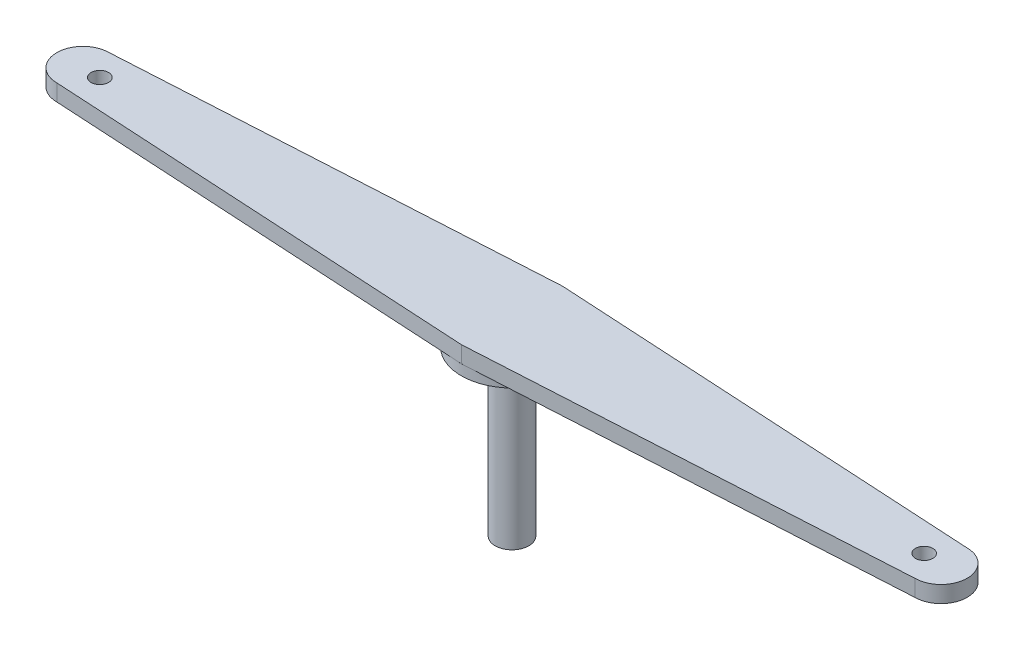
ISO-10303-21;
HEADER;
FILE_DESCRIPTION(('STEP AP214'),'2;1');
FILE_NAME('part.step','',(''),(''),'','','');
FILE_SCHEMA(('AUTOMOTIVE_DESIGN { 1 0 10303 214 1 1 1 1 }'));
ENDSEC;
DATA;
#1=APPLICATION_CONTEXT('core data for automotive mechanical design processes');
#2=APPLICATION_PROTOCOL_DEFINITION('international standard','automotive_design',2000,#1);
#3=PRODUCT_CONTEXT('',#1,'mechanical');
#4=PRODUCT('Part','Part','',(#3));
#5=PRODUCT_RELATED_PRODUCT_CATEGORY('part','',(#4));
#6=PRODUCT_DEFINITION_FORMATION('','',#4);
#7=PRODUCT_DEFINITION_CONTEXT('part definition',#1,'design');
#8=PRODUCT_DEFINITION('design','',#6,#7);
#9=PRODUCT_DEFINITION_SHAPE('','',#8);
#10=(LENGTH_UNIT() NAMED_UNIT(*) SI_UNIT(.MILLI.,.METRE.));
#11=(NAMED_UNIT(*) PLANE_ANGLE_UNIT() SI_UNIT($,.RADIAN.));
#12=(NAMED_UNIT(*) SI_UNIT($,.STERADIAN.) SOLID_ANGLE_UNIT());
#13=UNCERTAINTY_MEASURE_WITH_UNIT(LENGTH_MEASURE(1.E-05),#10,'distance_accuracy_value','');
#14=(GEOMETRIC_REPRESENTATION_CONTEXT(3) GLOBAL_UNCERTAINTY_ASSIGNED_CONTEXT((#13)) GLOBAL_UNIT_ASSIGNED_CONTEXT((#10,
#11,#12)) REPRESENTATION_CONTEXT('',''));
#15=CARTESIAN_POINT('',(0.,0.,0.));
#16=DIRECTION('',(0.,0.,1.));
#17=DIRECTION('',(1.,0.,0.));
#18=AXIS2_PLACEMENT_3D('',#15,#16,#17);
#19=CARTESIAN_POINT('',(0.,0.,0.));
#20=DIRECTION('',(0.,1.,0.));
#21=DIRECTION('',(0.,0.,1.));
#22=AXIS2_PLACEMENT_3D('',#19,#20,#21);
#23=PLANE('',#22);
#24=CARTESIAN_POINT('',(-118.059682160385,0.,0.));
#25=DIRECTION('',(0.,1.,0.));
#26=DIRECTION('',(0.,0.,1.));
#27=AXIS2_PLACEMENT_3D('',#24,#25,#26);
#28=CIRCLE('',#27,2.49999999999999);
#29=CARTESIAN_POINT('',(-118.059682160385,0.,2.49999999999999));
#30=VERTEX_POINT('',#29);
#31=EDGE_CURVE('E186',#30,#30,#28,.F.);
#32=ORIENTED_EDGE('',*,*,#31,.F.);
#33=EDGE_LOOP('',(#32));
#34=FACE_BOUND('',#33,.T.);
#35=CARTESIAN_POINT('',(0.,0.,0.));
#36=DIRECTION('',(0.,-1.,0.));
#37=DIRECTION('',(0.,0.,-1.));
#38=AXIS2_PLACEMENT_3D('',#35,#36,#37);
#39=CIRCLE('',#38,14.5);
#40=CARTESIAN_POINT('',(-1.64640830017799,0.,14.4062257274105));
#41=VERTEX_POINT('',#40);
#42=CARTESIAN_POINT('',(-1.64640830017799,0.,-14.4062257274105));
#43=VERTEX_POINT('',#42);
#44=EDGE_CURVE('E208',#41,#43,#39,.T.);
#45=ORIENTED_EDGE('',*,*,#44,.F.);
#46=DIRECTION('',(-0.998381893061701,0.,-0.0568647131930993));
#47=VECTOR('',#46,1.);
#48=CARTESIAN_POINT('',(-0.823204150088989,0.,14.4531128637053));
#49=LINE('',#48,#47);
#50=CARTESIAN_POINT('',(-122.9,0.,7.50000000000001));
#51=VERTEX_POINT('',#50);
#52=EDGE_CURVE('E164',#41,#51,#49,.T.);
#53=ORIENTED_EDGE('',*,*,#52,.T.);
#54=CARTESIAN_POINT('',(-122.9,0.,0.));
#55=DIRECTION('',(0.,1.,0.));
#56=DIRECTION('',(0.,0.,1.));
#57=AXIS2_PLACEMENT_3D('',#54,#55,#56);
#58=CIRCLE('',#57,7.50000000000001);
#59=CARTESIAN_POINT('',(-122.9,0.,-7.50000000000001));
#60=VERTEX_POINT('',#59);
#61=EDGE_CURVE('E161',#60,#51,#58,.T.);
#62=ORIENTED_EDGE('',*,*,#61,.F.);
#63=DIRECTION('',(-0.998381893061701,0.,0.0568647131930993));
#64=VECTOR('',#63,1.);
#65=CARTESIAN_POINT('',(-0.823204150088989,0.,-14.4531128637053));
#66=LINE('',#65,#64);
#67=EDGE_CURVE('E65',#43,#60,#66,.T.);
#68=ORIENTED_EDGE('',*,*,#67,.F.);
#69=EDGE_LOOP('',(#45,#53,#62,#68));
#70=FACE_BOUND('',#69,.T.);
#71=ADVANCED_FACE('F42',(#34,#70),#23,.F.);
#72=CARTESIAN_POINT('',(0.823204150088994,4.75,14.4531128637053));
#73=DIRECTION('',(0.0568647131930996,0.,0.998381893061701));
#74=DIRECTION('',(0.998381893061701,0.,-0.0568647131930996));
#75=AXIS2_PLACEMENT_3D('',#72,#73,#74);
#76=PLANE('',#75);
#77=DIRECTION('',(-0.998381893061701,0.,0.0568647131930996));
#78=VECTOR('',#77,1.);
#79=CARTESIAN_POINT('',(0.823204150088994,0.,14.4531128637053));
#80=LINE('',#79,#78);
#81=CARTESIAN_POINT('',(122.9,0.,7.49999999999997));
#82=VERTEX_POINT('',#81);
#83=CARTESIAN_POINT('',(1.64640830017796,0.,14.4062257274105));
#84=VERTEX_POINT('',#83);
#85=EDGE_CURVE('E106',#82,#84,#80,.T.);
#86=ORIENTED_EDGE('',*,*,#85,.F.);
#87=DIRECTION('',(0.,-1.,0.));
#88=VECTOR('',#87,1.);
#89=CARTESIAN_POINT('',(122.9,4.75,7.49999999999997));
#90=LINE('',#89,#88);
#91=CARTESIAN_POINT('',(122.9,4.75,7.49999999999997));
#92=VERTEX_POINT('',#91);
#93=EDGE_CURVE('E50',#92,#82,#90,.T.);
#94=ORIENTED_EDGE('',*,*,#93,.F.);
#95=DIRECTION('',(-0.998381893061701,0.,0.0568647131930996));
#96=VECTOR('',#95,1.);
#97=CARTESIAN_POINT('',(0.823204150088994,4.75,14.4531128637053));
#98=LINE('',#97,#96);
#99=CARTESIAN_POINT('',(0.,4.75,14.5));
#100=VERTEX_POINT('',#99);
#101=EDGE_CURVE('E139',#92,#100,#98,.T.);
#102=ORIENTED_EDGE('',*,*,#101,.T.);
#103=DIRECTION('',(0.,-1.,0.));
#104=VECTOR('',#103,1.);
#105=CARTESIAN_POINT('',(0.,4.75,14.5));
#106=LINE('',#105,#104);
#107=CARTESIAN_POINT('',(0.,0.,14.5));
#108=VERTEX_POINT('',#107);
#109=EDGE_CURVE('E117',#100,#108,#106,.T.);
#110=ORIENTED_EDGE('',*,*,#109,.T.);
#111=DIRECTION('',(0.998381893061701,0.,-0.0568647131930996));
#112=VECTOR('',#111,1.);
#113=CARTESIAN_POINT('',(0.823204150088994,0.,14.4531128637053));
#114=LINE('',#113,#112);
#115=EDGE_CURVE('E112',#108,#84,#114,.T.);
#116=ORIENTED_EDGE('',*,*,#115,.T.);
#117=EDGE_LOOP('',(#86,#94,#102,#110,#116));
#118=FACE_BOUND('',#117,.T.);
#119=ADVANCED_FACE('F44',(#118),#76,.T.);
#120=CARTESIAN_POINT('',(122.9,4.75,0.));
#121=DIRECTION('',(0.,-1.,0.));
#122=DIRECTION('',(0.,0.,-1.));
#123=AXIS2_PLACEMENT_3D('',#120,#121,#122);
#124=CYLINDRICAL_SURFACE('',#123,7.50000000000001);
#125=CARTESIAN_POINT('',(122.9,0.,0.));
#126=DIRECTION('',(0.,1.,0.));
#127=DIRECTION('',(0.,0.,1.));
#128=AXIS2_PLACEMENT_3D('',#125,#126,#127);
#129=CIRCLE('',#128,7.50000000000001);
#130=CARTESIAN_POINT('',(122.9,0.,-7.50000000000006));
#131=VERTEX_POINT('',#130);
#132=EDGE_CURVE('E110',#82,#131,#129,.T.);
#133=ORIENTED_EDGE('',*,*,#132,.T.);
#134=DIRECTION('',(0.,-1.,0.));
#135=VECTOR('',#134,1.);
#136=CARTESIAN_POINT('',(122.9,4.75,-7.50000000000006));
#137=LINE('',#136,#135);
#138=CARTESIAN_POINT('',(122.9,4.75,-7.50000000000006));
#139=VERTEX_POINT('',#138);
#140=EDGE_CURVE('E176',#139,#131,#137,.T.);
#141=ORIENTED_EDGE('',*,*,#140,.F.);
#142=CARTESIAN_POINT('',(122.9,4.75,0.));
#143=DIRECTION('',(0.,1.,0.));
#144=DIRECTION('',(0.,0.,1.));
#145=AXIS2_PLACEMENT_3D('',#142,#143,#144);
#146=CIRCLE('',#145,7.50000000000001);
#147=EDGE_CURVE('E141',#92,#139,#146,.T.);
#148=ORIENTED_EDGE('',*,*,#147,.F.);
#149=ORIENTED_EDGE('',*,*,#93,.T.);
#150=EDGE_LOOP('',(#133,#141,#148,#149));
#151=FACE_BOUND('',#150,.T.);
#152=ADVANCED_FACE('F258',(#151),#124,.T.);
#153=CARTESIAN_POINT('',(0.823204150088983,4.75,-14.4531128637053));
#154=DIRECTION('',(0.0568647131930989,0.,-0.998381893061702));
#155=DIRECTION('',(-0.998381893061702,0.,-0.0568647131930989));
#156=AXIS2_PLACEMENT_3D('',#153,#154,#155);
#157=PLANE('',#156);
#158=DIRECTION('',(0.998381893061701,0.,0.0568647131930989));
#159=VECTOR('',#158,1.);
#160=CARTESIAN_POINT('',(0.823204150088983,0.,-14.4531128637053));
#161=LINE('',#160,#159);
#162=CARTESIAN_POINT('',(0.,0.,-14.5));
#163=VERTEX_POINT('',#162);
#164=CARTESIAN_POINT('',(1.64640830017798,0.,-14.4062257274105));
#165=VERTEX_POINT('',#164);
#166=EDGE_CURVE('E156',#163,#165,#161,.T.);
#167=ORIENTED_EDGE('',*,*,#166,.F.);
#168=DIRECTION('',(0.,-1.,0.));
#169=VECTOR('',#168,1.);
#170=CARTESIAN_POINT('',(0.,4.75,-14.5));
#171=LINE('',#170,#169);
#172=CARTESIAN_POINT('',(0.,4.75,-14.5));
#173=VERTEX_POINT('',#172);
#174=EDGE_CURVE('E174',#173,#163,#171,.T.);
#175=ORIENTED_EDGE('',*,*,#174,.F.);
#176=DIRECTION('',(0.998381893061701,0.,0.0568647131930989));
#177=VECTOR('',#176,1.);
#178=CARTESIAN_POINT('',(0.823204150088983,4.75,-14.4531128637053));
#179=LINE('',#178,#177);
#180=EDGE_CURVE('E144',#173,#139,#179,.T.);
#181=ORIENTED_EDGE('',*,*,#180,.T.);
#182=ORIENTED_EDGE('',*,*,#140,.T.);
#183=EDGE_CURVE('E155',#165,#131,#161,.T.);
#184=ORIENTED_EDGE('',*,*,#183,.F.);
#185=EDGE_LOOP('',(#167,#175,#181,#182,#184));
#186=FACE_BOUND('',#185,.T.);
#187=ADVANCED_FACE('F244',(#186),#157,.T.);
#188=CARTESIAN_POINT('',(-0.823204150088989,4.75,-14.4531128637053));
#189=DIRECTION('',(0.0568647131930993,0.,0.998381893061702));
#190=DIRECTION('',(0.998381893061702,0.,-0.0568647131930993));
#191=AXIS2_PLACEMENT_3D('',#188,#189,#190);
#192=PLANE('',#191);
#193=EDGE_CURVE('E159',#163,#43,#66,.T.);
#194=ORIENTED_EDGE('',*,*,#193,.T.);
#195=ORIENTED_EDGE('',*,*,#67,.T.);
#196=DIRECTION('',(0.,-1.,0.));
#197=VECTOR('',#196,1.);
#198=CARTESIAN_POINT('',(-122.9,4.75,-7.50000000000001));
#199=LINE('',#198,#197);
#200=CARTESIAN_POINT('',(-122.9,4.75,-7.50000000000001));
#201=VERTEX_POINT('',#200);
#202=EDGE_CURVE('E171',#201,#60,#199,.T.);
#203=ORIENTED_EDGE('',*,*,#202,.F.);
#204=DIRECTION('',(-0.998381893061701,0.,0.0568647131930993));
#205=VECTOR('',#204,1.);
#206=CARTESIAN_POINT('',(-0.823204150088989,4.75,-14.4531128637053));
#207=LINE('',#206,#205);
#208=EDGE_CURVE('E147',#173,#201,#207,.T.);
#209=ORIENTED_EDGE('',*,*,#208,.F.);
#210=ORIENTED_EDGE('',*,*,#174,.T.);
#211=EDGE_LOOP('',(#194,#195,#203,#209,#210));
#212=FACE_BOUND('',#211,.T.);
#213=ADVANCED_FACE('F248',(#212),#192,.F.);
#214=CARTESIAN_POINT('',(-122.9,4.75,0.));
#215=DIRECTION('',(0.,-1.,0.));
#216=DIRECTION('',(0.,0.,-1.));
#217=AXIS2_PLACEMENT_3D('',#214,#215,#216);
#218=CYLINDRICAL_SURFACE('',#217,7.50000000000001);
#219=ORIENTED_EDGE('',*,*,#61,.T.);
#220=DIRECTION('',(0.,-1.,0.));
#221=VECTOR('',#220,1.);
#222=CARTESIAN_POINT('',(-122.9,4.75,7.50000000000001));
#223=LINE('',#222,#221);
#224=CARTESIAN_POINT('',(-122.9,4.75,7.50000000000001));
#225=VERTEX_POINT('',#224);
#226=EDGE_CURVE('E168',#225,#51,#223,.T.);
#227=ORIENTED_EDGE('',*,*,#226,.F.);
#228=CARTESIAN_POINT('',(-122.9,4.75,0.));
#229=DIRECTION('',(0.,1.,0.));
#230=DIRECTION('',(0.,0.,1.));
#231=AXIS2_PLACEMENT_3D('',#228,#229,#230);
#232=CIRCLE('',#231,7.50000000000001);
#233=EDGE_CURVE('E149',#201,#225,#232,.T.);
#234=ORIENTED_EDGE('',*,*,#233,.F.);
#235=ORIENTED_EDGE('',*,*,#202,.T.);
#236=EDGE_LOOP('',(#219,#227,#234,#235));
#237=FACE_BOUND('',#236,.T.);
#238=ADVANCED_FACE('F261',(#237),#218,.T.);
#239=CARTESIAN_POINT('',(-0.823204150088989,4.75,14.4531128637053));
#240=DIRECTION('',(-0.0568647131930993,0.,0.998381893061702));
#241=DIRECTION('',(0.998381893061702,0.,0.0568647131930993));
#242=AXIS2_PLACEMENT_3D('',#239,#240,#241);
#243=PLANE('',#242);
#244=EDGE_CURVE('E142',#108,#41,#49,.T.);
#245=ORIENTED_EDGE('',*,*,#244,.F.);
#246=ORIENTED_EDGE('',*,*,#109,.F.);
#247=DIRECTION('',(-0.998381893061701,0.,-0.0568647131930993));
#248=VECTOR('',#247,1.);
#249=CARTESIAN_POINT('',(-0.823204150088989,4.75,14.4531128637053));
#250=LINE('',#249,#248);
#251=EDGE_CURVE('E151',#100,#225,#250,.T.);
#252=ORIENTED_EDGE('',*,*,#251,.T.);
#253=ORIENTED_EDGE('',*,*,#226,.T.);
#254=ORIENTED_EDGE('',*,*,#52,.F.);
#255=EDGE_LOOP('',(#245,#246,#252,#253,#254));
#256=FACE_BOUND('',#255,.T.);
#257=ADVANCED_FACE('F211',(#256),#243,.T.);
#258=CARTESIAN_POINT('',(0.,4.75,0.));
#259=DIRECTION('',(0.,1.,0.));
#260=DIRECTION('',(0.,0.,1.));
#261=AXIS2_PLACEMENT_3D('',#258,#259,#260);
#262=PLANE('',#261);
#263=CARTESIAN_POINT('',(118.059682160385,4.75,0.));
#264=DIRECTION('',(0.,1.,0.));
#265=DIRECTION('',(0.,0.,-1.));
#266=AXIS2_PLACEMENT_3D('',#263,#264,#265);
#267=CIRCLE('',#266,2.49999999999999);
#268=CARTESIAN_POINT('',(118.059682160385,4.75,-2.49999999999999));
#269=VERTEX_POINT('',#268);
#270=EDGE_CURVE('E182',#269,#269,#267,.T.);
#271=ORIENTED_EDGE('',*,*,#270,.F.);
#272=EDGE_LOOP('',(#271));
#273=FACE_BOUND('',#272,.T.);
#274=CARTESIAN_POINT('',(-118.059682160385,4.75,0.));
#275=DIRECTION('',(0.,1.,0.));
#276=DIRECTION('',(0.,0.,1.));
#277=AXIS2_PLACEMENT_3D('',#274,#275,#276);
#278=CIRCLE('',#277,2.49999999999999);
#279=CARTESIAN_POINT('',(-118.059682160385,4.75,2.49999999999999));
#280=VERTEX_POINT('',#279);
#281=EDGE_CURVE('E181',#280,#280,#278,.T.);
#282=ORIENTED_EDGE('',*,*,#281,.F.);
#283=EDGE_LOOP('',(#282));
#284=FACE_BOUND('',#283,.T.);
#285=ORIENTED_EDGE('',*,*,#101,.F.);
#286=ORIENTED_EDGE('',*,*,#147,.T.);
#287=ORIENTED_EDGE('',*,*,#180,.F.);
#288=ORIENTED_EDGE('',*,*,#208,.T.);
#289=ORIENTED_EDGE('',*,*,#233,.T.);
#290=ORIENTED_EDGE('',*,*,#251,.F.);
#291=EDGE_LOOP('',(#285,#286,#287,#288,#289,#290));
#292=FACE_BOUND('',#291,.T.);
#293=ADVANCED_FACE('F254',(#273,#284,#292),#262,.T.);
#294=CARTESIAN_POINT('',(118.059682160385,0.,0.));
#295=DIRECTION('',(0.,1.,0.));
#296=DIRECTION('',(0.,0.,1.));
#297=AXIS2_PLACEMENT_3D('',#294,#295,#296);
#298=CIRCLE('',#297,2.49999999999999);
#299=CARTESIAN_POINT('',(118.059682160385,0.,2.49999999999999));
#300=VERTEX_POINT('',#299);
#301=EDGE_CURVE('E179',#300,#300,#298,.T.);
#302=ORIENTED_EDGE('',*,*,#301,.T.);
#303=EDGE_LOOP('',(#302));
#304=FACE_BOUND('',#303,.T.);
#305=CARTESIAN_POINT('',(111.778793876947,0.,0.));
#306=DIRECTION('',(0.,1.,0.));
#307=DIRECTION('',(0.,0.,1.));
#308=AXIS2_PLACEMENT_3D('',#305,#306,#307);
#309=CIRCLE('',#308,2.5);
#310=CARTESIAN_POINT('',(111.778793876947,0.,2.5));
#311=VERTEX_POINT('',#310);
#312=EDGE_CURVE('E198',#311,#311,#309,.F.);
#313=ORIENTED_EDGE('',*,*,#312,.F.);
#314=EDGE_LOOP('',(#313));
#315=FACE_BOUND('',#314,.T.);
#316=EDGE_CURVE('E57',#165,#84,#39,.T.);
#317=ORIENTED_EDGE('',*,*,#316,.F.);
#318=ORIENTED_EDGE('',*,*,#183,.T.);
#319=ORIENTED_EDGE('',*,*,#132,.F.);
#320=ORIENTED_EDGE('',*,*,#85,.T.);
#321=EDGE_LOOP('',(#317,#318,#319,#320));
#322=FACE_BOUND('',#321,.T.);
#323=ADVANCED_FACE('F108',(#304,#315,#322),#23,.F.);
#324=CARTESIAN_POINT('',(0.,0.,0.));
#325=DIRECTION('',(0.,-1.,0.));
#326=DIRECTION('',(0.,0.,-1.));
#327=AXIS2_PLACEMENT_3D('',#324,#325,#326);
#328=PLANE('',#327);
#329=EDGE_CURVE('E135',#43,#163,#39,.T.);
#330=ORIENTED_EDGE('',*,*,#329,.F.);
#331=ORIENTED_EDGE('',*,*,#193,.F.);
#332=EDGE_LOOP('',(#330,#331));
#333=FACE_BOUND('',#332,.T.);
#334=ADVANCED_FACE('F218',(#333),#328,.F.);
#335=ORIENTED_EDGE('',*,*,#166,.T.);
#336=EDGE_CURVE('E134',#163,#165,#39,.T.);
#337=ORIENTED_EDGE('',*,*,#336,.F.);
#338=EDGE_LOOP('',(#335,#337));
#339=FACE_BOUND('',#338,.T.);
#340=ADVANCED_FACE('F230',(#339),#328,.F.);
#341=ORIENTED_EDGE('',*,*,#115,.F.);
#342=EDGE_CURVE('E124',#84,#108,#39,.T.);
#343=ORIENTED_EDGE('',*,*,#342,.F.);
#344=EDGE_LOOP('',(#341,#343));
#345=FACE_BOUND('',#344,.T.);
#346=ADVANCED_FACE('F125',(#345),#328,.F.);
#347=CARTESIAN_POINT('',(0.,-3.,0.));
#348=DIRECTION('',(0.,1.,0.));
#349=DIRECTION('',(0.,0.,1.));
#350=AXIS2_PLACEMENT_3D('',#347,#348,#349);
#351=CYLINDRICAL_SURFACE('',#350,14.5);
#352=CARTESIAN_POINT('',(0.,-3.,0.));
#353=DIRECTION('',(0.,-1.,0.));
#354=DIRECTION('',(0.,0.,-1.));
#355=AXIS2_PLACEMENT_3D('',#352,#353,#354);
#356=CIRCLE('',#355,14.5);
#357=CARTESIAN_POINT('',(0.,-3.,-14.5));
#358=VERTEX_POINT('',#357);
#359=EDGE_CURVE('E121',#358,#358,#356,.T.);
#360=ORIENTED_EDGE('',*,*,#359,.F.);
#361=EDGE_LOOP('',(#360));
#362=FACE_BOUND('',#361,.T.);
#363=ORIENTED_EDGE('',*,*,#336,.T.);
#364=ORIENTED_EDGE('',*,*,#316,.T.);
#365=ORIENTED_EDGE('',*,*,#342,.T.);
#366=EDGE_CURVE('E128',#108,#41,#39,.T.);
#367=ORIENTED_EDGE('',*,*,#366,.T.);
#368=ORIENTED_EDGE('',*,*,#44,.T.);
#369=ORIENTED_EDGE('',*,*,#329,.T.);
#370=EDGE_LOOP('',(#363,#364,#365,#367,#368,#369));
#371=FACE_BOUND('',#370,.T.);
#372=ADVANCED_FACE('F131',(#362,#371),#351,.T.);
#373=CARTESIAN_POINT('',(0.,-3.,0.));
#374=DIRECTION('',(0.,-1.,0.));
#375=DIRECTION('',(0.,0.,-1.));
#376=AXIS2_PLACEMENT_3D('',#373,#374,#375);
#377=PLANE('',#376);
#378=CARTESIAN_POINT('',(0.,-3.,0.));
#379=DIRECTION('',(0.,-1.,0.));
#380=DIRECTION('',(0.,0.,-1.));
#381=AXIS2_PLACEMENT_3D('',#378,#379,#380);
#382=CIRCLE('',#381,4.825);
#383=CARTESIAN_POINT('',(0.,-3.,-4.825));
#384=VERTEX_POINT('',#383);
#385=EDGE_CURVE('E11',#384,#384,#382,.T.);
#386=ORIENTED_EDGE('',*,*,#385,.F.);
#387=EDGE_LOOP('',(#386));
#388=FACE_BOUND('',#387,.T.);
#389=ORIENTED_EDGE('',*,*,#359,.T.);
#390=EDGE_LOOP('',(#389));
#391=FACE_BOUND('',#390,.T.);
#392=ADVANCED_FACE('F216',(#388,#391),#377,.T.);
#393=ORIENTED_EDGE('',*,*,#244,.T.);
#394=ORIENTED_EDGE('',*,*,#366,.F.);
#395=EDGE_LOOP('',(#393,#394));
#396=FACE_BOUND('',#395,.T.);
#397=ADVANCED_FACE('F214',(#396),#328,.F.);
#398=CARTESIAN_POINT('',(-118.059682160385,-50.001,0.));
#399=DIRECTION('',(0.,1.,0.));
#400=DIRECTION('',(0.,0.,1.));
#401=AXIS2_PLACEMENT_3D('',#398,#399,#400);
#402=CYLINDRICAL_SURFACE('',#401,2.49999999999999);
#403=ORIENTED_EDGE('',*,*,#281,.T.);
#404=EDGE_LOOP('',(#403));
#405=FACE_BOUND('',#404,.T.);
#406=ORIENTED_EDGE('',*,*,#31,.T.);
#407=EDGE_LOOP('',(#406));
#408=FACE_BOUND('',#407,.T.);
#409=ADVANCED_FACE('F203',(#405,#408),#402,.F.);
#410=CARTESIAN_POINT('',(118.059682160385,-0.25,0.));
#411=DIRECTION('',(0.,1.,0.));
#412=DIRECTION('',(0.,0.,1.));
#413=AXIS2_PLACEMENT_3D('',#410,#411,#412);
#414=CYLINDRICAL_SURFACE('',#413,2.49999999999999);
#415=ORIENTED_EDGE('',*,*,#270,.T.);
#416=EDGE_LOOP('',(#415));
#417=FACE_BOUND('',#416,.T.);
#418=ORIENTED_EDGE('',*,*,#301,.F.);
#419=EDGE_LOOP('',(#418));
#420=FACE_BOUND('',#419,.T.);
#421=ADVANCED_FACE('F223',(#417,#420),#414,.F.);
#422=CARTESIAN_POINT('',(111.778793876947,-0.25,0.));
#423=DIRECTION('',(0.,1.,0.));
#424=DIRECTION('',(0.,0.,1.));
#425=AXIS2_PLACEMENT_3D('',#422,#423,#424);
#426=CYLINDRICAL_SURFACE('',#425,2.49999999999999);
#427=CARTESIAN_POINT('',(111.778793876947,-0.25,0.));
#428=DIRECTION('',(0.,1.,0.));
#429=DIRECTION('',(0.,0.,1.));
#430=AXIS2_PLACEMENT_3D('',#427,#428,#429);
#431=CIRCLE('',#430,2.49999999999999);
#432=CARTESIAN_POINT('',(111.778793876947,-0.25,2.49999999999999));
#433=VERTEX_POINT('',#432);
#434=EDGE_CURVE('E189',#433,#433,#431,.T.);
#435=ORIENTED_EDGE('',*,*,#434,.T.);
#436=EDGE_LOOP('',(#435));
#437=FACE_BOUND('',#436,.T.);
#438=ORIENTED_EDGE('',*,*,#312,.T.);
#439=EDGE_LOOP('',(#438));
#440=FACE_BOUND('',#439,.T.);
#441=ADVANCED_FACE('F313',(#437,#440),#426,.T.);
#442=CARTESIAN_POINT('',(111.778793876947,-0.25,0.));
#443=DIRECTION('',(0.,1.,0.));
#444=DIRECTION('',(0.,0.,1.));
#445=AXIS2_PLACEMENT_3D('',#442,#443,#444);
#446=PLANE('',#445);
#447=ORIENTED_EDGE('',*,*,#434,.F.);
#448=EDGE_LOOP('',(#447));
#449=FACE_BOUND('',#448,.T.);
#450=ADVANCED_FACE('F331',(#449),#446,.F.);
#451=CARTESIAN_POINT('',(0.,4.752,0.));
#452=DIRECTION('',(0.,-1.,0.));
#453=DIRECTION('',(0.,0.,-1.));
#454=AXIS2_PLACEMENT_3D('',#451,#452,#453);
#455=CYLINDRICAL_SURFACE('',#454,4.825);
#456=ORIENTED_EDGE('',*,*,#385,.T.);
#457=EDGE_LOOP('',(#456));
#458=FACE_BOUND('',#457,.T.);
#459=CARTESIAN_POINT('',(0.,-50.,0.));
#460=DIRECTION('',(0.,-1.,0.));
#461=DIRECTION('',(0.,0.,-1.));
#462=AXIS2_PLACEMENT_3D('',#459,#460,#461);
#463=CIRCLE('',#462,4.825);
#464=CARTESIAN_POINT('',(0.,-50.,-4.825));
#465=VERTEX_POINT('',#464);
#466=EDGE_CURVE('E194',#465,#465,#463,.T.);
#467=ORIENTED_EDGE('',*,*,#466,.F.);
#468=EDGE_LOOP('',(#467));
#469=FACE_BOUND('',#468,.T.);
#470=ADVANCED_FACE('F341',(#458,#469),#455,.T.);
#471=CARTESIAN_POINT('',(0.,-50.,0.));
#472=DIRECTION('',(0.,1.,0.));
#473=DIRECTION('',(0.,0.,1.));
#474=AXIS2_PLACEMENT_3D('',#471,#472,#473);
#475=PLANE('',#474);
#476=CARTESIAN_POINT('',(0.,-50.,0.));
#477=DIRECTION('',(0.,-1.,0.));
#478=DIRECTION('',(0.,0.,-1.));
#479=AXIS2_PLACEMENT_3D('',#476,#477,#478);
#480=CIRCLE('',#479,2.);
#481=CARTESIAN_POINT('',(0.,-50.,-2.));
#482=VERTEX_POINT('',#481);
#483=EDGE_CURVE('E395',#482,#482,#480,.T.);
#484=ORIENTED_EDGE('',*,*,#483,.F.);
#485=EDGE_LOOP('',(#484));
#486=FACE_BOUND('',#485,.T.);
#487=ORIENTED_EDGE('',*,*,#466,.T.);
#488=EDGE_LOOP('',(#487));
#489=FACE_BOUND('',#488,.T.);
#490=ADVANCED_FACE('F358',(#486,#489),#475,.F.);
#491=CARTESIAN_POINT('',(0.,-47.,0.));
#492=DIRECTION('',(0.,-1.,0.));
#493=DIRECTION('',(0.,0.,-1.));
#494=AXIS2_PLACEMENT_3D('',#491,#492,#493);
#495=CYLINDRICAL_SURFACE('',#494,2.);
#496=CARTESIAN_POINT('',(0.,-47.,0.));
#497=DIRECTION('',(0.,-1.,0.));
#498=DIRECTION('',(0.,0.,-1.));
#499=AXIS2_PLACEMENT_3D('',#496,#497,#498);
#500=CIRCLE('',#499,2.);
#501=CARTESIAN_POINT('',(0.,-47.,-2.));
#502=VERTEX_POINT('',#501);
#503=EDGE_CURVE('E394',#502,#502,#500,.T.);
#504=ORIENTED_EDGE('',*,*,#503,.F.);
#505=EDGE_LOOP('',(#504));
#506=FACE_BOUND('',#505,.T.);
#507=ORIENTED_EDGE('',*,*,#483,.T.);
#508=EDGE_LOOP('',(#507));
#509=FACE_BOUND('',#508,.T.);
#510=ADVANCED_FACE('F368',(#506,#509),#495,.F.);
#511=CARTESIAN_POINT('',(0.,-47.,0.));
#512=DIRECTION('',(0.,-1.,0.));
#513=DIRECTION('',(0.,0.,-1.));
#514=AXIS2_PLACEMENT_3D('',#511,#512,#513);
#515=PLANE('',#514);
#516=ORIENTED_EDGE('',*,*,#503,.T.);
#517=EDGE_LOOP('',(#516));
#518=FACE_BOUND('',#517,.T.);
#519=ADVANCED_FACE('F378',(#518),#515,.T.);
#520=CLOSED_SHELL('',(#71,#119,#152,#187,#213,#238,#257,#293,#323,#334,#340,#346,#372,#392,#397,
#409,#421,#441,#450,#470,#490,#510,#519));
#521=MANIFOLD_SOLID_BREP('B2',#520);
#522=ADVANCED_BREP_SHAPE_REPRESENTATION('',(#18,#521),#14);
#523=SHAPE_DEFINITION_REPRESENTATION(#9,#522);
ENDSEC;
END-ISO-10303-21;
